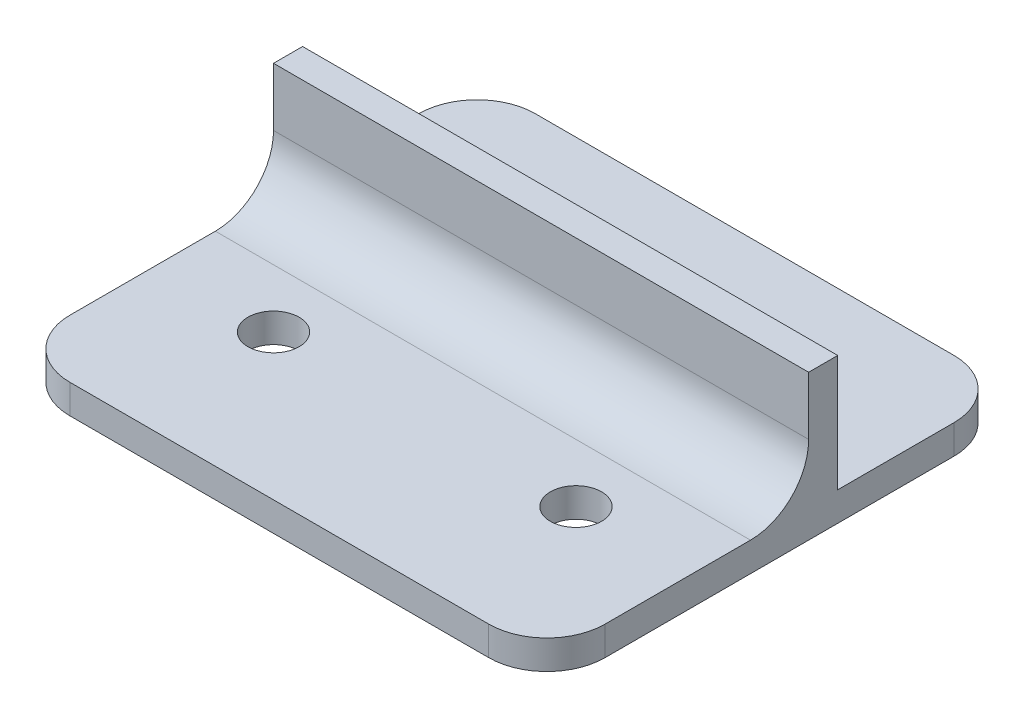
ISO-10303-21;
HEADER;
FILE_DESCRIPTION(('STEP AP214'),'2;1');
FILE_NAME('part.step','',(''),(''),'','','');
FILE_SCHEMA(('AUTOMOTIVE_DESIGN { 1 0 10303 214 1 1 1 1 }'));
ENDSEC;
DATA;
#1=APPLICATION_CONTEXT('core data for automotive mechanical design processes');
#2=APPLICATION_PROTOCOL_DEFINITION('international standard','automotive_design',2000,#1);
#3=PRODUCT_CONTEXT('',#1,'mechanical');
#4=PRODUCT('Part','Part','',(#3));
#5=PRODUCT_RELATED_PRODUCT_CATEGORY('part','',(#4));
#6=PRODUCT_DEFINITION_FORMATION('','',#4);
#7=PRODUCT_DEFINITION_CONTEXT('part definition',#1,'design');
#8=PRODUCT_DEFINITION('design','',#6,#7);
#9=PRODUCT_DEFINITION_SHAPE('','',#8);
#10=(LENGTH_UNIT() NAMED_UNIT(*) SI_UNIT(.MILLI.,.METRE.));
#11=(NAMED_UNIT(*) PLANE_ANGLE_UNIT() SI_UNIT($,.RADIAN.));
#12=(NAMED_UNIT(*) SI_UNIT($,.STERADIAN.) SOLID_ANGLE_UNIT());
#13=UNCERTAINTY_MEASURE_WITH_UNIT(LENGTH_MEASURE(1.E-05),#10,'distance_accuracy_value','');
#14=(GEOMETRIC_REPRESENTATION_CONTEXT(3) GLOBAL_UNCERTAINTY_ASSIGNED_CONTEXT((#13)) GLOBAL_UNIT_ASSIGNED_CONTEXT((#10,
#11,#12)) REPRESENTATION_CONTEXT('',''));
#15=CARTESIAN_POINT('',(0.,0.,0.));
#16=DIRECTION('',(0.,0.,1.));
#17=DIRECTION('',(1.,0.,0.));
#18=AXIS2_PLACEMENT_3D('',#15,#16,#17);
#19=CARTESIAN_POINT('',(-46.,10.,5.00000000000001));
#20=DIRECTION('',(1.,0.,0.));
#21=DIRECTION('',(0.,0.,-1.));
#22=AXIS2_PLACEMENT_3D('',#19,#20,#21);
#23=CYLINDRICAL_SURFACE('',#22,10.);
#24=DIRECTION('',(1.,0.,0.));
#25=VECTOR('',#24,1.);
#26=CARTESIAN_POINT('',(-46.,10.,-4.99999999999999));
#27=LINE('',#26,#25);
#28=CARTESIAN_POINT('',(-46.,10.,-4.99999999999999));
#29=VERTEX_POINT('',#28);
#30=CARTESIAN_POINT('',(46.,10.,-5.));
#31=VERTEX_POINT('',#30);
#32=EDGE_CURVE('E225',#29,#31,#27,.T.);
#33=ORIENTED_EDGE('',*,*,#32,.F.);
#34=CARTESIAN_POINT('',(-46.,10.,5.00000000000001));
#35=DIRECTION('',(-1.,0.,0.));
#36=DIRECTION('',(0.,0.,1.));
#37=AXIS2_PLACEMENT_3D('',#34,#35,#36);
#38=CIRCLE('',#37,10.);
#39=CARTESIAN_POINT('',(-46.,0.,5.00000000000001));
#40=VERTEX_POINT('',#39);
#41=EDGE_CURVE('E46',#29,#40,#38,.T.);
#42=ORIENTED_EDGE('',*,*,#41,.T.);
#43=DIRECTION('',(1.,0.,0.));
#44=VECTOR('',#43,1.);
#45=CARTESIAN_POINT('',(36.,0.,5.00000000000001));
#46=LINE('',#45,#44);
#47=CARTESIAN_POINT('',(46.,0.,5.));
#48=VERTEX_POINT('',#47);
#49=EDGE_CURVE('E241',#48,#40,#46,.F.);
#50=ORIENTED_EDGE('',*,*,#49,.F.);
#51=CARTESIAN_POINT('',(46.,10.,5.));
#52=DIRECTION('',(1.,0.,0.));
#53=DIRECTION('',(0.,0.,-1.));
#54=AXIS2_PLACEMENT_3D('',#51,#52,#53);
#55=CIRCLE('',#54,10.);
#56=EDGE_CURVE('E11',#48,#31,#55,.T.);
#57=ORIENTED_EDGE('',*,*,#56,.T.);
#58=EDGE_LOOP('',(#33,#42,#50,#57));
#59=FACE_BOUND('',#58,.T.);
#60=ADVANCED_FACE('F39',(#59),#23,.F.);
#61=CARTESIAN_POINT('',(36.,0.,-30.));
#62=DIRECTION('',(0.,1.,0.));
#63=DIRECTION('',(0.,0.,1.));
#64=AXIS2_PLACEMENT_3D('',#61,#62,#63);
#65=PLANE('',#64);
#66=CARTESIAN_POINT('',(-26.,0.,-24.));
#67=DIRECTION('',(0.,1.,0.));
#68=DIRECTION('',(0.,0.,1.));
#69=AXIS2_PLACEMENT_3D('',#66,#67,#68);
#70=CIRCLE('',#69,2.77385657345732);
#71=CARTESIAN_POINT('',(-26.,0.,-21.2261434265427));
#72=VERTEX_POINT('',#71);
#73=EDGE_CURVE('E290',#72,#72,#70,.F.);
#74=ORIENTED_EDGE('',*,*,#73,.T.);
#75=EDGE_LOOP('',(#74));
#76=FACE_BOUND('',#75,.T.);
#77=CARTESIAN_POINT('',(26.,0.,-24.));
#78=DIRECTION('',(0.,1.,0.));
#79=DIRECTION('',(0.,0.,1.));
#80=AXIS2_PLACEMENT_3D('',#77,#78,#79);
#81=CIRCLE('',#80,2.77385657345732);
#82=CARTESIAN_POINT('',(26.,0.,-21.2261434265427));
#83=VERTEX_POINT('',#82);
#84=EDGE_CURVE('E287',#83,#83,#81,.F.);
#85=ORIENTED_EDGE('',*,*,#84,.T.);
#86=EDGE_LOOP('',(#85));
#87=FACE_BOUND('',#86,.T.);
#88=DIRECTION('',(-1.,0.,0.));
#89=VECTOR('',#88,1.);
#90=CARTESIAN_POINT('',(-46.,0.,-9.99999999999999));
#91=LINE('',#90,#89);
#92=CARTESIAN_POINT('',(46.,0.,-9.99999999999999));
#93=VERTEX_POINT('',#92);
#94=CARTESIAN_POINT('',(-46.,0.,-9.99999999999999));
#95=VERTEX_POINT('',#94);
#96=EDGE_CURVE('E150',#93,#95,#91,.T.);
#97=ORIENTED_EDGE('',*,*,#96,.F.);
#98=DIRECTION('',(0.,0.,-1.));
#99=VECTOR('',#98,1.);
#100=CARTESIAN_POINT('',(46.,0.,-29.9999999999999));
#101=LINE('',#100,#99);
#102=CARTESIAN_POINT('',(46.,0.,-29.9999999999999));
#103=VERTEX_POINT('',#102);
#104=EDGE_CURVE('E219',#93,#103,#101,.T.);
#105=ORIENTED_EDGE('',*,*,#104,.T.);
#106=CARTESIAN_POINT('',(36.,0.,-30.));
#107=DIRECTION('',(0.,1.,0.));
#108=DIRECTION('',(0.,0.,1.));
#109=AXIS2_PLACEMENT_3D('',#106,#107,#108);
#110=CIRCLE('',#109,10.);
#111=CARTESIAN_POINT('',(35.9999999999999,0.,-40.));
#112=VERTEX_POINT('',#111);
#113=EDGE_CURVE('E170',#103,#112,#110,.T.);
#114=ORIENTED_EDGE('',*,*,#113,.T.);
#115=DIRECTION('',(-1.,0.,0.));
#116=VECTOR('',#115,1.);
#117=CARTESIAN_POINT('',(-35.9999999999999,0.,-40.));
#118=LINE('',#117,#116);
#119=CARTESIAN_POINT('',(-35.9999999999999,0.,-40.));
#120=VERTEX_POINT('',#119);
#121=EDGE_CURVE('E201',#112,#120,#118,.T.);
#122=ORIENTED_EDGE('',*,*,#121,.T.);
#123=CARTESIAN_POINT('',(-36.,0.,-30.));
#124=DIRECTION('',(0.,1.,0.));
#125=DIRECTION('',(0.,0.,1.));
#126=AXIS2_PLACEMENT_3D('',#123,#124,#125);
#127=CIRCLE('',#126,10.);
#128=CARTESIAN_POINT('',(-46.,0.,-29.9999999999999));
#129=VERTEX_POINT('',#128);
#130=EDGE_CURVE('E204',#120,#129,#127,.T.);
#131=ORIENTED_EDGE('',*,*,#130,.T.);
#132=DIRECTION('',(0.,0.,1.));
#133=VECTOR('',#132,1.);
#134=CARTESIAN_POINT('',(-46.,0.,-29.9999999999999));
#135=LINE('',#134,#133);
#136=EDGE_CURVE('E208',#129,#95,#135,.T.);
#137=ORIENTED_EDGE('',*,*,#136,.T.);
#138=EDGE_LOOP('',(#97,#105,#114,#122,#131,#137));
#139=FACE_BOUND('',#138,.T.);
#140=ADVANCED_FACE('F271',(#76,#87,#139),#65,.T.);
#141=CARTESIAN_POINT('',(36.,-5.,-30.));
#142=DIRECTION('',(0.,1.,0.));
#143=DIRECTION('',(0.,0.,1.));
#144=AXIS2_PLACEMENT_3D('',#141,#142,#143);
#145=CYLINDRICAL_SURFACE('',#144,10.);
#146=ORIENTED_EDGE('',*,*,#113,.F.);
#147=DIRECTION('',(0.,1.,0.));
#148=VECTOR('',#147,1.);
#149=CARTESIAN_POINT('',(46.,-5.,-29.9999999999999));
#150=LINE('',#149,#148);
#151=CARTESIAN_POINT('',(46.,-5.,-29.9999999999999));
#152=VERTEX_POINT('',#151);
#153=EDGE_CURVE('E222',#152,#103,#150,.T.);
#154=ORIENTED_EDGE('',*,*,#153,.F.);
#155=CARTESIAN_POINT('',(36.,-5.,-30.));
#156=DIRECTION('',(0.,1.,0.));
#157=DIRECTION('',(0.,0.,1.));
#158=AXIS2_PLACEMENT_3D('',#155,#156,#157);
#159=CIRCLE('',#158,10.);
#160=CARTESIAN_POINT('',(35.9999999999999,-5.,-40.));
#161=VERTEX_POINT('',#160);
#162=EDGE_CURVE('E173',#152,#161,#159,.T.);
#163=ORIENTED_EDGE('',*,*,#162,.T.);
#164=DIRECTION('',(0.,1.,0.));
#165=VECTOR('',#164,1.);
#166=CARTESIAN_POINT('',(35.9999999999999,-5.,-40.));
#167=LINE('',#166,#165);
#168=EDGE_CURVE('E198',#161,#112,#167,.T.);
#169=ORIENTED_EDGE('',*,*,#168,.T.);
#170=EDGE_LOOP('',(#146,#154,#163,#169));
#171=FACE_BOUND('',#170,.T.);
#172=ADVANCED_FACE('F268',(#171),#145,.T.);
#173=CARTESIAN_POINT('',(46.,-5.,-29.9999999999999));
#174=DIRECTION('',(1.,0.,0.));
#175=DIRECTION('',(0.,0.,-1.));
#176=AXIS2_PLACEMENT_3D('',#173,#174,#175);
#177=PLANE('',#176);
#178=CARTESIAN_POINT('',(46.,0.,29.9999999999999));
#179=VERTEX_POINT('',#178);
#180=EDGE_CURVE('E177',#179,#48,#101,.T.);
#181=ORIENTED_EDGE('',*,*,#180,.F.);
#182=DIRECTION('',(0.,1.,0.));
#183=VECTOR('',#182,1.);
#184=CARTESIAN_POINT('',(46.,-5.,29.9999999999999));
#185=LINE('',#184,#183);
#186=CARTESIAN_POINT('',(46.,-5.,29.9999999999999));
#187=VERTEX_POINT('',#186);
#188=EDGE_CURVE('E226',#187,#179,#185,.T.);
#189=ORIENTED_EDGE('',*,*,#188,.F.);
#190=DIRECTION('',(0.,0.,-1.));
#191=VECTOR('',#190,1.);
#192=CARTESIAN_POINT('',(46.,-5.,-29.9999999999999));
#193=LINE('',#192,#191);
#194=EDGE_CURVE('E195',#187,#152,#193,.T.);
#195=ORIENTED_EDGE('',*,*,#194,.T.);
#196=ORIENTED_EDGE('',*,*,#153,.T.);
#197=ORIENTED_EDGE('',*,*,#104,.F.);
#198=DIRECTION('',(0.,-1.,0.));
#199=VECTOR('',#198,1.);
#200=CARTESIAN_POINT('',(46.,20.,-9.99999999999999));
#201=LINE('',#200,#199);
#202=CARTESIAN_POINT('',(46.,20.,-9.99999999999999));
#203=VERTEX_POINT('',#202);
#204=EDGE_CURVE('E160',#203,#93,#201,.T.);
#205=ORIENTED_EDGE('',*,*,#204,.F.);
#206=DIRECTION('',(0.,0.,-1.));
#207=VECTOR('',#206,1.);
#208=CARTESIAN_POINT('',(46.,20.,-5.));
#209=LINE('',#208,#207);
#210=CARTESIAN_POINT('',(46.,20.,-5.));
#211=VERTEX_POINT('',#210);
#212=EDGE_CURVE('E140',#211,#203,#209,.T.);
#213=ORIENTED_EDGE('',*,*,#212,.F.);
#214=DIRECTION('',(0.,-1.,0.));
#215=VECTOR('',#214,1.);
#216=CARTESIAN_POINT('',(46.,20.,-5.));
#217=LINE('',#216,#215);
#218=EDGE_CURVE('E137',#211,#31,#217,.T.);
#219=ORIENTED_EDGE('',*,*,#218,.T.);
#220=ORIENTED_EDGE('',*,*,#56,.F.);
#221=EDGE_LOOP('',(#181,#189,#195,#196,#197,#205,#213,#219,#220));
#222=FACE_BOUND('',#221,.T.);
#223=ADVANCED_FACE('F259',(#222),#177,.T.);
#224=CARTESIAN_POINT('',(36.,-5.,30.));
#225=DIRECTION('',(0.,1.,0.));
#226=DIRECTION('',(0.,0.,1.));
#227=AXIS2_PLACEMENT_3D('',#224,#225,#226);
#228=CYLINDRICAL_SURFACE('',#227,10.);
#229=CARTESIAN_POINT('',(36.,0.,30.));
#230=DIRECTION('',(0.,1.,0.));
#231=DIRECTION('',(0.,0.,1.));
#232=AXIS2_PLACEMENT_3D('',#229,#230,#231);
#233=CIRCLE('',#232,10.);
#234=CARTESIAN_POINT('',(35.9999999999999,0.,40.));
#235=VERTEX_POINT('',#234);
#236=EDGE_CURVE('E216',#235,#179,#233,.T.);
#237=ORIENTED_EDGE('',*,*,#236,.F.);
#238=DIRECTION('',(0.,1.,0.));
#239=VECTOR('',#238,1.);
#240=CARTESIAN_POINT('',(35.9999999999999,-5.,40.));
#241=LINE('',#240,#239);
#242=CARTESIAN_POINT('',(35.9999999999999,-5.,40.));
#243=VERTEX_POINT('',#242);
#244=EDGE_CURVE('E228',#243,#235,#241,.T.);
#245=ORIENTED_EDGE('',*,*,#244,.F.);
#246=CARTESIAN_POINT('',(36.,-5.,30.));
#247=DIRECTION('',(0.,1.,0.));
#248=DIRECTION('',(0.,0.,1.));
#249=AXIS2_PLACEMENT_3D('',#246,#247,#248);
#250=CIRCLE('',#249,10.);
#251=EDGE_CURVE('E192',#243,#187,#250,.T.);
#252=ORIENTED_EDGE('',*,*,#251,.T.);
#253=ORIENTED_EDGE('',*,*,#188,.T.);
#254=EDGE_LOOP('',(#237,#245,#252,#253));
#255=FACE_BOUND('',#254,.T.);
#256=ADVANCED_FACE('F257',(#255),#228,.T.);
#257=CARTESIAN_POINT('',(-35.9999999999999,-5.,40.));
#258=DIRECTION('',(0.,0.,1.));
#259=DIRECTION('',(1.,0.,0.));
#260=AXIS2_PLACEMENT_3D('',#257,#258,#259);
#261=PLANE('',#260);
#262=DIRECTION('',(1.,0.,0.));
#263=VECTOR('',#262,1.);
#264=CARTESIAN_POINT('',(-35.9999999999999,0.,40.));
#265=LINE('',#264,#263);
#266=CARTESIAN_POINT('',(-35.9999999999999,0.,40.));
#267=VERTEX_POINT('',#266);
#268=EDGE_CURVE('E213',#267,#235,#265,.T.);
#269=ORIENTED_EDGE('',*,*,#268,.F.);
#270=DIRECTION('',(0.,1.,0.));
#271=VECTOR('',#270,1.);
#272=CARTESIAN_POINT('',(-35.9999999999999,-5.,40.));
#273=LINE('',#272,#271);
#274=CARTESIAN_POINT('',(-35.9999999999999,-5.,40.));
#275=VERTEX_POINT('',#274);
#276=EDGE_CURVE('E230',#275,#267,#273,.T.);
#277=ORIENTED_EDGE('',*,*,#276,.F.);
#278=DIRECTION('',(1.,0.,0.));
#279=VECTOR('',#278,1.);
#280=CARTESIAN_POINT('',(-35.9999999999999,-5.,40.));
#281=LINE('',#280,#279);
#282=EDGE_CURVE('E189',#275,#243,#281,.T.);
#283=ORIENTED_EDGE('',*,*,#282,.T.);
#284=ORIENTED_EDGE('',*,*,#244,.T.);
#285=EDGE_LOOP('',(#269,#277,#283,#284));
#286=FACE_BOUND('',#285,.T.);
#287=ADVANCED_FACE('F253',(#286),#261,.T.);
#288=CARTESIAN_POINT('',(-36.,-5.,30.));
#289=DIRECTION('',(0.,1.,0.));
#290=DIRECTION('',(0.,0.,1.));
#291=AXIS2_PLACEMENT_3D('',#288,#289,#290);
#292=CYLINDRICAL_SURFACE('',#291,10.);
#293=CARTESIAN_POINT('',(-36.,0.,30.));
#294=DIRECTION('',(0.,1.,0.));
#295=DIRECTION('',(0.,0.,-1.));
#296=AXIS2_PLACEMENT_3D('',#293,#294,#295);
#297=CIRCLE('',#296,10.);
#298=CARTESIAN_POINT('',(-46.,0.,29.9999999999999));
#299=VERTEX_POINT('',#298);
#300=EDGE_CURVE('E210',#299,#267,#297,.T.);
#301=ORIENTED_EDGE('',*,*,#300,.F.);
#302=DIRECTION('',(0.,1.,0.));
#303=VECTOR('',#302,1.);
#304=CARTESIAN_POINT('',(-46.,-5.,29.9999999999999));
#305=LINE('',#304,#303);
#306=CARTESIAN_POINT('',(-46.,-5.,29.9999999999999));
#307=VERTEX_POINT('',#306);
#308=EDGE_CURVE('E232',#307,#299,#305,.T.);
#309=ORIENTED_EDGE('',*,*,#308,.F.);
#310=CARTESIAN_POINT('',(-36.,-5.,30.));
#311=DIRECTION('',(0.,1.,0.));
#312=DIRECTION('',(0.,0.,-1.));
#313=AXIS2_PLACEMENT_3D('',#310,#311,#312);
#314=CIRCLE('',#313,10.);
#315=EDGE_CURVE('E186',#307,#275,#314,.T.);
#316=ORIENTED_EDGE('',*,*,#315,.T.);
#317=ORIENTED_EDGE('',*,*,#276,.T.);
#318=EDGE_LOOP('',(#301,#309,#316,#317));
#319=FACE_BOUND('',#318,.T.);
#320=ADVANCED_FACE('F249',(#319),#292,.T.);
#321=CARTESIAN_POINT('',(-46.,-5.,-29.9999999999999));
#322=DIRECTION('',(-1.,0.,0.));
#323=DIRECTION('',(0.,0.,1.));
#324=AXIS2_PLACEMENT_3D('',#321,#322,#323);
#325=PLANE('',#324);
#326=ORIENTED_EDGE('',*,*,#136,.F.);
#327=DIRECTION('',(0.,1.,0.));
#328=VECTOR('',#327,1.);
#329=CARTESIAN_POINT('',(-46.,-5.,-29.9999999999999));
#330=LINE('',#329,#328);
#331=CARTESIAN_POINT('',(-46.,-5.,-29.9999999999999));
#332=VERTEX_POINT('',#331);
#333=EDGE_CURVE('E235',#332,#129,#330,.T.);
#334=ORIENTED_EDGE('',*,*,#333,.F.);
#335=DIRECTION('',(0.,0.,1.));
#336=VECTOR('',#335,1.);
#337=CARTESIAN_POINT('',(-46.,-5.,-29.9999999999999));
#338=LINE('',#337,#336);
#339=EDGE_CURVE('E183',#332,#307,#338,.T.);
#340=ORIENTED_EDGE('',*,*,#339,.T.);
#341=ORIENTED_EDGE('',*,*,#308,.T.);
#342=EDGE_CURVE('E207',#40,#299,#135,.T.);
#343=ORIENTED_EDGE('',*,*,#342,.F.);
#344=ORIENTED_EDGE('',*,*,#41,.F.);
#345=DIRECTION('',(0.,-1.,0.));
#346=VECTOR('',#345,1.);
#347=CARTESIAN_POINT('',(-46.,20.,-4.99999999999999));
#348=LINE('',#347,#346);
#349=CARTESIAN_POINT('',(-46.,20.,-4.99999999999999));
#350=VERTEX_POINT('',#349);
#351=EDGE_CURVE('E136',#350,#29,#348,.T.);
#352=ORIENTED_EDGE('',*,*,#351,.F.);
#353=DIRECTION('',(0.,0.,1.));
#354=VECTOR('',#353,1.);
#355=CARTESIAN_POINT('',(-46.,20.,-9.99999999999999));
#356=LINE('',#355,#354);
#357=CARTESIAN_POINT('',(-46.,20.,-9.99999999999999));
#358=VERTEX_POINT('',#357);
#359=EDGE_CURVE('E141',#358,#350,#356,.T.);
#360=ORIENTED_EDGE('',*,*,#359,.F.);
#361=DIRECTION('',(0.,-1.,0.));
#362=VECTOR('',#361,1.);
#363=CARTESIAN_POINT('',(-46.,20.,-9.99999999999999));
#364=LINE('',#363,#362);
#365=EDGE_CURVE('E277',#358,#95,#364,.T.);
#366=ORIENTED_EDGE('',*,*,#365,.T.);
#367=EDGE_LOOP('',(#326,#334,#340,#341,#343,#344,#352,#360,#366));
#368=FACE_BOUND('',#367,.T.);
#369=ADVANCED_FACE('F153',(#368),#325,.T.);
#370=CARTESIAN_POINT('',(-36.,-5.,-30.));
#371=DIRECTION('',(0.,1.,0.));
#372=DIRECTION('',(0.,0.,1.));
#373=AXIS2_PLACEMENT_3D('',#370,#371,#372);
#374=CYLINDRICAL_SURFACE('',#373,10.);
#375=ORIENTED_EDGE('',*,*,#130,.F.);
#376=DIRECTION('',(0.,1.,0.));
#377=VECTOR('',#376,1.);
#378=CARTESIAN_POINT('',(-35.9999999999999,-5.,-40.));
#379=LINE('',#378,#377);
#380=CARTESIAN_POINT('',(-35.9999999999999,-5.,-40.));
#381=VERTEX_POINT('',#380);
#382=EDGE_CURVE('E237',#381,#120,#379,.T.);
#383=ORIENTED_EDGE('',*,*,#382,.F.);
#384=CARTESIAN_POINT('',(-36.,-5.,-30.));
#385=DIRECTION('',(0.,1.,0.));
#386=DIRECTION('',(0.,0.,1.));
#387=AXIS2_PLACEMENT_3D('',#384,#385,#386);
#388=CIRCLE('',#387,10.);
#389=EDGE_CURVE('E180',#381,#332,#388,.T.);
#390=ORIENTED_EDGE('',*,*,#389,.T.);
#391=ORIENTED_EDGE('',*,*,#333,.T.);
#392=EDGE_LOOP('',(#375,#383,#390,#391));
#393=FACE_BOUND('',#392,.T.);
#394=ADVANCED_FACE('F345',(#393),#374,.T.);
#395=CARTESIAN_POINT('',(-35.9999999999999,-5.,-40.));
#396=DIRECTION('',(0.,0.,-1.));
#397=DIRECTION('',(-1.,0.,0.));
#398=AXIS2_PLACEMENT_3D('',#395,#396,#397);
#399=PLANE('',#398);
#400=ORIENTED_EDGE('',*,*,#121,.F.);
#401=ORIENTED_EDGE('',*,*,#168,.F.);
#402=DIRECTION('',(-1.,0.,0.));
#403=VECTOR('',#402,1.);
#404=CARTESIAN_POINT('',(-35.9999999999999,-5.,-40.));
#405=LINE('',#404,#403);
#406=EDGE_CURVE('E176',#161,#381,#405,.T.);
#407=ORIENTED_EDGE('',*,*,#406,.T.);
#408=ORIENTED_EDGE('',*,*,#382,.T.);
#409=EDGE_LOOP('',(#400,#401,#407,#408));
#410=FACE_BOUND('',#409,.T.);
#411=ADVANCED_FACE('F301',(#410),#399,.T.);
#412=CARTESIAN_POINT('',(36.,-5.,-30.));
#413=DIRECTION('',(0.,1.,0.));
#414=DIRECTION('',(0.,0.,1.));
#415=AXIS2_PLACEMENT_3D('',#412,#413,#414);
#416=PLANE('',#415);
#417=CARTESIAN_POINT('',(-26.,-5.,-24.));
#418=DIRECTION('',(0.,-1.,0.));
#419=DIRECTION('',(0.,0.,-1.));
#420=AXIS2_PLACEMENT_3D('',#417,#418,#419);
#421=CIRCLE('',#420,5.);
#422=CARTESIAN_POINT('',(-26.,-5.,-29.));
#423=VERTEX_POINT('',#422);
#424=EDGE_CURVE('E281',#423,#423,#421,.T.);
#425=ORIENTED_EDGE('',*,*,#424,.F.);
#426=EDGE_LOOP('',(#425));
#427=FACE_BOUND('',#426,.T.);
#428=CARTESIAN_POINT('',(26.,-5.,-24.));
#429=DIRECTION('',(0.,-1.,0.));
#430=DIRECTION('',(0.,0.,-1.));
#431=AXIS2_PLACEMENT_3D('',#428,#429,#430);
#432=CIRCLE('',#431,5.);
#433=CARTESIAN_POINT('',(26.,-5.,-29.));
#434=VERTEX_POINT('',#433);
#435=EDGE_CURVE('E284',#434,#434,#432,.T.);
#436=ORIENTED_EDGE('',*,*,#435,.F.);
#437=EDGE_LOOP('',(#436));
#438=FACE_BOUND('',#437,.T.);
#439=CARTESIAN_POINT('',(26.,-5.,15.));
#440=DIRECTION('',(0.,1.,0.));
#441=DIRECTION('',(0.,0.,1.));
#442=AXIS2_PLACEMENT_3D('',#439,#440,#441);
#443=CIRCLE('',#442,4.4);
#444=CARTESIAN_POINT('',(26.,-5.,19.4));
#445=VERTEX_POINT('',#444);
#446=EDGE_CURVE('E158',#445,#445,#443,.T.);
#447=ORIENTED_EDGE('',*,*,#446,.T.);
#448=EDGE_LOOP('',(#447));
#449=FACE_BOUND('',#448,.T.);
#450=CARTESIAN_POINT('',(-26.,-5.,15.));
#451=DIRECTION('',(0.,1.,0.));
#452=DIRECTION('',(0.,0.,1.));
#453=AXIS2_PLACEMENT_3D('',#450,#451,#452);
#454=CIRCLE('',#453,4.4);
#455=CARTESIAN_POINT('',(-26.,-5.,19.4));
#456=VERTEX_POINT('',#455);
#457=EDGE_CURVE('E167',#456,#456,#454,.T.);
#458=ORIENTED_EDGE('',*,*,#457,.T.);
#459=EDGE_LOOP('',(#458));
#460=FACE_BOUND('',#459,.T.);
#461=ORIENTED_EDGE('',*,*,#162,.F.);
#462=ORIENTED_EDGE('',*,*,#194,.F.);
#463=ORIENTED_EDGE('',*,*,#251,.F.);
#464=ORIENTED_EDGE('',*,*,#282,.F.);
#465=ORIENTED_EDGE('',*,*,#315,.F.);
#466=ORIENTED_EDGE('',*,*,#339,.F.);
#467=ORIENTED_EDGE('',*,*,#389,.F.);
#468=ORIENTED_EDGE('',*,*,#406,.F.);
#469=EDGE_LOOP('',(#461,#462,#463,#464,#465,#466,#467,#468));
#470=FACE_BOUND('',#469,.T.);
#471=ADVANCED_FACE('F264',(#427,#438,#449,#460,#470),#416,.F.);
#472=ORIENTED_EDGE('',*,*,#180,.T.);
#473=ORIENTED_EDGE('',*,*,#49,.T.);
#474=ORIENTED_EDGE('',*,*,#342,.T.);
#475=ORIENTED_EDGE('',*,*,#300,.T.);
#476=ORIENTED_EDGE('',*,*,#268,.T.);
#477=ORIENTED_EDGE('',*,*,#236,.T.);
#478=EDGE_LOOP('',(#472,#473,#474,#475,#476,#477));
#479=FACE_BOUND('',#478,.T.);
#480=CARTESIAN_POINT('',(26.,0.,15.));
#481=DIRECTION('',(0.,1.,0.));
#482=DIRECTION('',(0.,0.,1.));
#483=AXIS2_PLACEMENT_3D('',#480,#481,#482);
#484=CIRCLE('',#483,4.4);
#485=CARTESIAN_POINT('',(26.,0.,19.4));
#486=VERTEX_POINT('',#485);
#487=EDGE_CURVE('E155',#486,#486,#484,.T.);
#488=ORIENTED_EDGE('',*,*,#487,.F.);
#489=EDGE_LOOP('',(#488));
#490=FACE_BOUND('',#489,.T.);
#491=CARTESIAN_POINT('',(-26.,0.,15.));
#492=DIRECTION('',(0.,1.,0.));
#493=DIRECTION('',(0.,0.,1.));
#494=AXIS2_PLACEMENT_3D('',#491,#492,#493);
#495=CIRCLE('',#494,4.4);
#496=CARTESIAN_POINT('',(-26.,0.,19.4));
#497=VERTEX_POINT('',#496);
#498=EDGE_CURVE('E165',#497,#497,#495,.T.);
#499=ORIENTED_EDGE('',*,*,#498,.F.);
#500=EDGE_LOOP('',(#499));
#501=FACE_BOUND('',#500,.T.);
#502=ADVANCED_FACE('F243',(#479,#490,#501),#65,.T.);
#503=CARTESIAN_POINT('',(-26.,-5.,15.));
#504=DIRECTION('',(0.,1.,0.));
#505=DIRECTION('',(0.,0.,1.));
#506=AXIS2_PLACEMENT_3D('',#503,#504,#505);
#507=CYLINDRICAL_SURFACE('',#506,4.4);
#508=ORIENTED_EDGE('',*,*,#457,.F.);
#509=EDGE_LOOP('',(#508));
#510=FACE_BOUND('',#509,.T.);
#511=ORIENTED_EDGE('',*,*,#498,.T.);
#512=EDGE_LOOP('',(#511));
#513=FACE_BOUND('',#512,.T.);
#514=ADVANCED_FACE('F309',(#510,#513),#507,.F.);
#515=CARTESIAN_POINT('',(26.,-5.,15.));
#516=DIRECTION('',(0.,1.,0.));
#517=DIRECTION('',(0.,0.,1.));
#518=AXIS2_PLACEMENT_3D('',#515,#516,#517);
#519=CYLINDRICAL_SURFACE('',#518,4.4);
#520=ORIENTED_EDGE('',*,*,#446,.F.);
#521=EDGE_LOOP('',(#520));
#522=FACE_BOUND('',#521,.T.);
#523=ORIENTED_EDGE('',*,*,#487,.T.);
#524=EDGE_LOOP('',(#523));
#525=FACE_BOUND('',#524,.T.);
#526=ADVANCED_FACE('F312',(#522,#525),#519,.F.);
#527=CARTESIAN_POINT('',(-46.,20.,-4.99999999999999));
#528=DIRECTION('',(0.,0.,-1.));
#529=DIRECTION('',(-1.,0.,0.));
#530=AXIS2_PLACEMENT_3D('',#527,#528,#529);
#531=PLANE('',#530);
#532=ORIENTED_EDGE('',*,*,#351,.T.);
#533=ORIENTED_EDGE('',*,*,#32,.T.);
#534=ORIENTED_EDGE('',*,*,#218,.F.);
#535=DIRECTION('',(1.,0.,0.));
#536=VECTOR('',#535,1.);
#537=CARTESIAN_POINT('',(-46.,20.,-4.99999999999999));
#538=LINE('',#537,#536);
#539=EDGE_CURVE('E131',#350,#211,#538,.T.);
#540=ORIENTED_EDGE('',*,*,#539,.F.);
#541=EDGE_LOOP('',(#532,#533,#534,#540));
#542=FACE_BOUND('',#541,.T.);
#543=ADVANCED_FACE('F133',(#542),#531,.F.);
#544=CARTESIAN_POINT('',(-46.,20.,-9.99999999999999));
#545=DIRECTION('',(0.,0.,1.));
#546=DIRECTION('',(1.,0.,0.));
#547=AXIS2_PLACEMENT_3D('',#544,#545,#546);
#548=PLANE('',#547);
#549=ORIENTED_EDGE('',*,*,#96,.T.);
#550=ORIENTED_EDGE('',*,*,#365,.F.);
#551=DIRECTION('',(-1.,0.,0.));
#552=VECTOR('',#551,1.);
#553=CARTESIAN_POINT('',(-46.,20.,-9.99999999999999));
#554=LINE('',#553,#552);
#555=EDGE_CURVE('E146',#203,#358,#554,.T.);
#556=ORIENTED_EDGE('',*,*,#555,.F.);
#557=ORIENTED_EDGE('',*,*,#204,.T.);
#558=EDGE_LOOP('',(#549,#550,#556,#557));
#559=FACE_BOUND('',#558,.T.);
#560=ADVANCED_FACE('F276',(#559),#548,.F.);
#561=CARTESIAN_POINT('',(0.,20.,0.));
#562=DIRECTION('',(0.,1.,0.));
#563=DIRECTION('',(0.,0.,1.));
#564=AXIS2_PLACEMENT_3D('',#561,#562,#563);
#565=PLANE('',#564);
#566=ORIENTED_EDGE('',*,*,#359,.T.);
#567=ORIENTED_EDGE('',*,*,#539,.T.);
#568=ORIENTED_EDGE('',*,*,#212,.T.);
#569=ORIENTED_EDGE('',*,*,#555,.T.);
#570=EDGE_LOOP('',(#566,#567,#568,#569));
#571=FACE_BOUND('',#570,.T.);
#572=ADVANCED_FACE('F144',(#571),#565,.T.);
#573=CARTESIAN_POINT('',(26.,-5.,-24.));
#574=DIRECTION('',(0.,-1.,0.));
#575=DIRECTION('',(0.,0.,-1.));
#576=AXIS2_PLACEMENT_3D('',#573,#574,#575);
#577=CONICAL_SURFACE('',#576,5.,0.418879020478639);
#578=ORIENTED_EDGE('',*,*,#435,.T.);
#579=EDGE_LOOP('',(#578));
#580=FACE_BOUND('',#579,.T.);
#581=ORIENTED_EDGE('',*,*,#84,.F.);
#582=EDGE_LOOP('',(#581));
#583=FACE_BOUND('',#582,.T.);
#584=ADVANCED_FACE('F374',(#580,#583),#577,.F.);
#585=CARTESIAN_POINT('',(-26.,-5.,-24.));
#586=DIRECTION('',(0.,-1.,0.));
#587=DIRECTION('',(0.,0.,-1.));
#588=AXIS2_PLACEMENT_3D('',#585,#586,#587);
#589=CONICAL_SURFACE('',#588,5.,0.418879020478639);
#590=ORIENTED_EDGE('',*,*,#424,.T.);
#591=EDGE_LOOP('',(#590));
#592=FACE_BOUND('',#591,.T.);
#593=ORIENTED_EDGE('',*,*,#73,.F.);
#594=EDGE_LOOP('',(#593));
#595=FACE_BOUND('',#594,.T.);
#596=ADVANCED_FACE('F296',(#592,#595),#589,.F.);
#597=CLOSED_SHELL('',(#60,#140,#172,#223,#256,#287,#320,#369,#394,#411,#471,#502,#514,#526,#543,
#560,#572,#584,#596));
#598=MANIFOLD_SOLID_BREP('B2',#597);
#599=ADVANCED_BREP_SHAPE_REPRESENTATION('',(#18,#598),#14);
#600=SHAPE_DEFINITION_REPRESENTATION(#9,#599);
ENDSEC;
END-ISO-10303-21;
